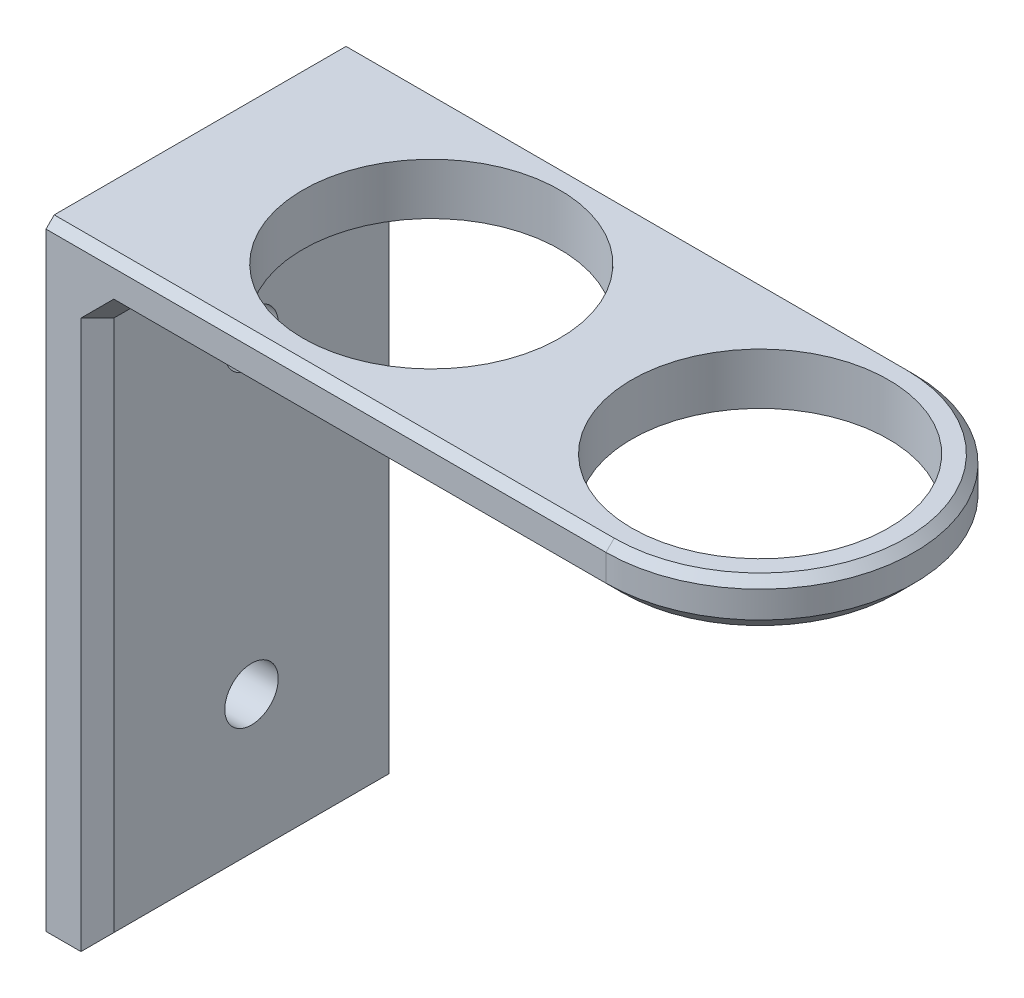
ISO-10303-21;
HEADER;
FILE_DESCRIPTION(('STEP AP214'),'2;1');
FILE_NAME('part.step','',(''),(''),'','','');
FILE_SCHEMA(('AUTOMOTIVE_DESIGN { 1 0 10303 214 1 1 1 1 }'));
ENDSEC;
DATA;
#1=APPLICATION_CONTEXT('core data for automotive mechanical design processes');
#2=APPLICATION_PROTOCOL_DEFINITION('international standard','automotive_design',2000,#1);
#3=PRODUCT_CONTEXT('',#1,'mechanical');
#4=PRODUCT('Part','Part','',(#3));
#5=PRODUCT_RELATED_PRODUCT_CATEGORY('part','',(#4));
#6=PRODUCT_DEFINITION_FORMATION('','',#4);
#7=PRODUCT_DEFINITION_CONTEXT('part definition',#1,'design');
#8=PRODUCT_DEFINITION('design','',#6,#7);
#9=PRODUCT_DEFINITION_SHAPE('','',#8);
#10=(LENGTH_UNIT() NAMED_UNIT(*) SI_UNIT(.MILLI.,.METRE.));
#11=(NAMED_UNIT(*) PLANE_ANGLE_UNIT() SI_UNIT($,.RADIAN.));
#12=(NAMED_UNIT(*) SI_UNIT($,.STERADIAN.) SOLID_ANGLE_UNIT());
#13=UNCERTAINTY_MEASURE_WITH_UNIT(LENGTH_MEASURE(1.E-05),#10,'distance_accuracy_value','');
#14=(GEOMETRIC_REPRESENTATION_CONTEXT(3) GLOBAL_UNCERTAINTY_ASSIGNED_CONTEXT((#13)) GLOBAL_UNIT_ASSIGNED_CONTEXT((#10,
#11,#12)) REPRESENTATION_CONTEXT('',''));
#15=CARTESIAN_POINT('',(0.,0.,0.));
#16=DIRECTION('',(0.,0.,1.));
#17=DIRECTION('',(1.,0.,0.));
#18=AXIS2_PLACEMENT_3D('',#15,#16,#17);
#19=CARTESIAN_POINT('',(6.35,0.,0.));
#20=DIRECTION('',(0.,0.,1.));
#21=DIRECTION('',(1.,0.,0.));
#22=AXIS2_PLACEMENT_3D('',#19,#20,#21);
#23=PLANE('',#22);
#24=DIRECTION('',(0.,1.,0.));
#25=VECTOR('',#24,1.);
#26=CARTESIAN_POINT('',(0.,0.,0.));
#27=LINE('',#26,#25);
#28=CARTESIAN_POINT('',(0.,-38.1,0.));
#29=VERTEX_POINT('',#28);
#30=CARTESIAN_POINT('',(0.,37.084,0.));
#31=VERTEX_POINT('',#30);
#32=EDGE_CURVE('E256',#29,#31,#27,.T.);
#33=ORIENTED_EDGE('',*,*,#32,.T.);
#34=DIRECTION('',(1.,0.,0.));
#35=VECTOR('',#34,1.);
#36=CARTESIAN_POINT('',(6.35,37.084,0.));
#37=LINE('',#36,#35);
#38=CARTESIAN_POINT('',(69.215,37.084,0.));
#39=VERTEX_POINT('',#38);
#40=EDGE_CURVE('E67',#31,#39,#37,.T.);
#41=ORIENTED_EDGE('',*,*,#40,.T.);
#42=DIRECTION('',(0.,1.,0.));
#43=VECTOR('',#42,1.);
#44=CARTESIAN_POINT('',(69.215,31.75,0.));
#45=LINE('',#44,#43);
#46=CARTESIAN_POINT('',(69.215,33.782,0.));
#47=VERTEX_POINT('',#46);
#48=EDGE_CURVE('E278',#47,#39,#45,.T.);
#49=ORIENTED_EDGE('',*,*,#48,.F.);
#50=DIRECTION('',(-1.,0.,0.));
#51=VECTOR('',#50,1.);
#52=CARTESIAN_POINT('',(6.35,33.782,0.));
#53=LINE('',#52,#51);
#54=CARTESIAN_POINT('',(8.38199999999999,33.782,0.));
#55=VERTEX_POINT('',#54);
#56=EDGE_CURVE('E150',#47,#55,#53,.T.);
#57=ORIENTED_EDGE('',*,*,#56,.T.);
#58=DIRECTION('',(0.707106781186548,0.707106781186548,0.));
#59=VECTOR('',#58,1.);
#60=CARTESIAN_POINT('',(8.38199999999999,33.782,0.));
#61=LINE('',#60,#59);
#62=CARTESIAN_POINT('',(6.35,31.75,0.));
#63=VERTEX_POINT('',#62);
#64=EDGE_CURVE('E145',#63,#55,#61,.T.);
#65=ORIENTED_EDGE('',*,*,#64,.F.);
#66=DIRECTION('',(0.707106781186548,0.707106781186548,0.));
#67=VECTOR('',#66,1.);
#68=CARTESIAN_POINT('',(8.38199999999999,33.782,0.));
#69=LINE('',#68,#67);
#70=CARTESIAN_POINT('',(4.31800000000001,29.718,0.));
#71=VERTEX_POINT('',#70);
#72=EDGE_CURVE('E147',#71,#63,#69,.T.);
#73=ORIENTED_EDGE('',*,*,#72,.F.);
#74=DIRECTION('',(0.,-1.,0.));
#75=VECTOR('',#74,1.);
#76=CARTESIAN_POINT('',(4.31800000000001,-38.1,0.));
#77=LINE('',#76,#75);
#78=CARTESIAN_POINT('',(4.31800000000001,-38.1,0.));
#79=VERTEX_POINT('',#78);
#80=EDGE_CURVE('E160',#71,#79,#77,.T.);
#81=ORIENTED_EDGE('',*,*,#80,.T.);
#82=DIRECTION('',(-1.,0.,0.));
#83=VECTOR('',#82,1.);
#84=CARTESIAN_POINT('',(6.35,-38.1,0.));
#85=LINE('',#84,#83);
#86=EDGE_CURVE('E263',#79,#29,#85,.T.);
#87=ORIENTED_EDGE('',*,*,#86,.T.);
#88=EDGE_LOOP('',(#33,#41,#49,#57,#65,#73,#81,#87));
#89=FACE_BOUND('',#88,.T.);
#90=ADVANCED_FACE('F42',(#89),#23,.F.);
#91=CARTESIAN_POINT('',(6.35,38.1,0.));
#92=DIRECTION('',(0.,-1.,0.));
#93=DIRECTION('',(0.,0.,-1.));
#94=AXIS2_PLACEMENT_3D('',#91,#92,#93);
#95=PLANE('',#94);
#96=CARTESIAN_POINT('',(69.215,38.1,19.05));
#97=DIRECTION('',(0.,-1.,0.));
#98=DIRECTION('',(0.,0.,-1.));
#99=AXIS2_PLACEMENT_3D('',#96,#97,#98);
#100=CIRCLE('',#99,18.034);
#101=CARTESIAN_POINT('',(69.215,38.1,37.084));
#102=VERTEX_POINT('',#101);
#103=CARTESIAN_POINT('',(69.215,38.1,1.01599999999999));
#104=VERTEX_POINT('',#103);
#105=EDGE_CURVE('E215',#102,#104,#100,.F.);
#106=ORIENTED_EDGE('',*,*,#105,.T.);
#107=DIRECTION('',(-1.,0.,0.));
#108=VECTOR('',#107,1.);
#109=CARTESIAN_POINT('',(6.35,38.1,1.01599999999999));
#110=LINE('',#109,#108);
#111=CARTESIAN_POINT('',(0.,38.1,1.01599999999999));
#112=VERTEX_POINT('',#111);
#113=EDGE_CURVE('E217',#104,#112,#110,.T.);
#114=ORIENTED_EDGE('',*,*,#113,.T.);
#115=DIRECTION('',(0.,0.,1.));
#116=VECTOR('',#115,1.);
#117=CARTESIAN_POINT('',(0.,38.1,0.));
#118=LINE('',#117,#116);
#119=CARTESIAN_POINT('',(0.,38.1,37.084));
#120=VERTEX_POINT('',#119);
#121=EDGE_CURVE('E254',#112,#120,#118,.T.);
#122=ORIENTED_EDGE('',*,*,#121,.T.);
#123=DIRECTION('',(1.,0.,0.));
#124=VECTOR('',#123,1.);
#125=CARTESIAN_POINT('',(6.35,38.1,37.084));
#126=LINE('',#125,#124);
#127=EDGE_CURVE('E188',#120,#102,#126,.T.);
#128=ORIENTED_EDGE('',*,*,#127,.T.);
#129=EDGE_LOOP('',(#106,#114,#122,#128));
#130=FACE_BOUND('',#129,.T.);
#131=CARTESIAN_POINT('',(69.215,38.1,19.05));
#132=DIRECTION('',(0.,1.,0.));
#133=DIRECTION('',(0.,0.,1.));
#134=AXIS2_PLACEMENT_3D('',#131,#132,#133);
#135=CIRCLE('',#134,15.875);
#136=CARTESIAN_POINT('',(69.215,38.1,34.925));
#137=VERTEX_POINT('',#136);
#138=EDGE_CURVE('E213',#137,#137,#135,.T.);
#139=ORIENTED_EDGE('',*,*,#138,.F.);
#140=EDGE_LOOP('',(#139));
#141=FACE_BOUND('',#140,.T.);
#142=CARTESIAN_POINT('',(28.575,38.1,19.05));
#143=DIRECTION('',(0.,1.,0.));
#144=DIRECTION('',(0.,0.,1.));
#145=AXIS2_PLACEMENT_3D('',#142,#143,#144);
#146=CIRCLE('',#145,15.875);
#147=CARTESIAN_POINT('',(28.575,38.1,34.925));
#148=VERTEX_POINT('',#147);
#149=EDGE_CURVE('E596',#148,#148,#146,.T.);
#150=ORIENTED_EDGE('',*,*,#149,.F.);
#151=EDGE_LOOP('',(#150));
#152=FACE_BOUND('',#151,.T.);
#153=ADVANCED_FACE('F319',(#130,#141,#152),#95,.F.);
#154=CARTESIAN_POINT('',(6.35,0.,38.1));
#155=DIRECTION('',(0.,0.,-1.));
#156=DIRECTION('',(-1.,0.,0.));
#157=AXIS2_PLACEMENT_3D('',#154,#155,#156);
#158=PLANE('',#157);
#159=DIRECTION('',(0.,1.,0.));
#160=VECTOR('',#159,1.);
#161=CARTESIAN_POINT('',(69.215,31.75,38.1));
#162=LINE('',#161,#160);
#163=CARTESIAN_POINT('',(69.215,33.782,38.1));
#164=VERTEX_POINT('',#163);
#165=CARTESIAN_POINT('',(69.215,37.084,38.1));
#166=VERTEX_POINT('',#165);
#167=EDGE_CURVE('E245',#164,#166,#162,.T.);
#168=ORIENTED_EDGE('',*,*,#167,.T.);
#169=DIRECTION('',(-1.,0.,0.));
#170=VECTOR('',#169,1.);
#171=CARTESIAN_POINT('',(6.35,37.084,38.1));
#172=LINE('',#171,#170);
#173=CARTESIAN_POINT('',(0.,37.084,38.1));
#174=VERTEX_POINT('',#173);
#175=EDGE_CURVE('E11',#166,#174,#172,.T.);
#176=ORIENTED_EDGE('',*,*,#175,.T.);
#177=DIRECTION('',(0.,-1.,0.));
#178=VECTOR('',#177,1.);
#179=CARTESIAN_POINT('',(0.,0.,38.1));
#180=LINE('',#179,#178);
#181=CARTESIAN_POINT('',(0.,-38.1,38.1));
#182=VERTEX_POINT('',#181);
#183=EDGE_CURVE('E243',#174,#182,#180,.T.);
#184=ORIENTED_EDGE('',*,*,#183,.T.);
#185=DIRECTION('',(-1.,0.,0.));
#186=VECTOR('',#185,1.);
#187=CARTESIAN_POINT('',(6.35,-38.1,38.1));
#188=LINE('',#187,#186);
#189=CARTESIAN_POINT('',(4.31800000000001,-38.1,38.1));
#190=VERTEX_POINT('',#189);
#191=EDGE_CURVE('E265',#190,#182,#188,.T.);
#192=ORIENTED_EDGE('',*,*,#191,.F.);
#193=DIRECTION('',(0.,1.,0.));
#194=VECTOR('',#193,1.);
#195=CARTESIAN_POINT('',(4.31800000000001,31.75,38.1));
#196=LINE('',#195,#194);
#197=CARTESIAN_POINT('',(4.31800000000001,29.718,38.1));
#198=VERTEX_POINT('',#197);
#199=EDGE_CURVE('E173',#190,#198,#196,.T.);
#200=ORIENTED_EDGE('',*,*,#199,.T.);
#201=DIRECTION('',(-0.707106781186548,-0.707106781186548,0.));
#202=VECTOR('',#201,1.);
#203=CARTESIAN_POINT('',(4.31800000000001,29.718,38.1));
#204=LINE('',#203,#202);
#205=CARTESIAN_POINT('',(6.35,31.75,38.1));
#206=VERTEX_POINT('',#205);
#207=EDGE_CURVE('E167',#206,#198,#204,.T.);
#208=ORIENTED_EDGE('',*,*,#207,.F.);
#209=DIRECTION('',(-0.707106781186548,-0.707106781186548,0.));
#210=VECTOR('',#209,1.);
#211=CARTESIAN_POINT('',(4.31800000000001,29.718,38.1));
#212=LINE('',#211,#210);
#213=CARTESIAN_POINT('',(8.38199999999999,33.782,38.1));
#214=VERTEX_POINT('',#213);
#215=EDGE_CURVE('E170',#214,#206,#212,.T.);
#216=ORIENTED_EDGE('',*,*,#215,.F.);
#217=DIRECTION('',(1.,0.,0.));
#218=VECTOR('',#217,1.);
#219=CARTESIAN_POINT('',(6.35,33.782,38.1));
#220=LINE('',#219,#218);
#221=EDGE_CURVE('E175',#214,#164,#220,.T.);
#222=ORIENTED_EDGE('',*,*,#221,.T.);
#223=EDGE_LOOP('',(#168,#176,#184,#192,#200,#208,#216,#222));
#224=FACE_BOUND('',#223,.T.);
#225=ADVANCED_FACE('F241',(#224),#158,.F.);
#226=CARTESIAN_POINT('',(6.35,-38.1,0.));
#227=DIRECTION('',(0.,1.,0.));
#228=DIRECTION('',(0.,0.,1.));
#229=AXIS2_PLACEMENT_3D('',#226,#227,#228);
#230=PLANE('',#229);
#231=ORIENTED_EDGE('',*,*,#86,.F.);
#232=DIRECTION('',(0.,0.,1.));
#233=VECTOR('',#232,1.);
#234=CARTESIAN_POINT('',(4.31800000000001,-38.1,38.1));
#235=LINE('',#234,#233);
#236=EDGE_CURVE('E186',#79,#190,#235,.T.);
#237=ORIENTED_EDGE('',*,*,#236,.T.);
#238=ORIENTED_EDGE('',*,*,#191,.T.);
#239=DIRECTION('',(0.,0.,-1.));
#240=VECTOR('',#239,1.);
#241=CARTESIAN_POINT('',(0.,-38.1,0.));
#242=LINE('',#241,#240);
#243=EDGE_CURVE('E253',#182,#29,#242,.T.);
#244=ORIENTED_EDGE('',*,*,#243,.T.);
#245=EDGE_LOOP('',(#231,#237,#238,#244));
#246=FACE_BOUND('',#245,.T.);
#247=ADVANCED_FACE('F313',(#246),#230,.F.);
#248=CARTESIAN_POINT('',(6.35,0.,0.));
#249=DIRECTION('',(1.,0.,0.));
#250=DIRECTION('',(0.,0.,-1.));
#251=AXIS2_PLACEMENT_3D('',#248,#249,#250);
#252=PLANE('',#251);
#253=DIRECTION('',(0.,-1.,0.));
#254=VECTOR('',#253,1.);
#255=CARTESIAN_POINT('',(6.35,-38.1,36.068));
#256=LINE('',#255,#254);
#257=CARTESIAN_POINT('',(6.35,29.718,36.068));
#258=VERTEX_POINT('',#257);
#259=CARTESIAN_POINT('',(6.35,-36.068,36.068));
#260=VERTEX_POINT('',#259);
#261=EDGE_CURVE('E179',#258,#260,#256,.T.);
#262=ORIENTED_EDGE('',*,*,#261,.T.);
#263=DIRECTION('',(0.,0.,-1.));
#264=VECTOR('',#263,1.);
#265=CARTESIAN_POINT('',(6.35,-36.068,0.));
#266=LINE('',#265,#264);
#267=CARTESIAN_POINT('',(6.35,-36.068,2.03199999999999));
#268=VERTEX_POINT('',#267);
#269=EDGE_CURVE('E183',#260,#268,#266,.T.);
#270=ORIENTED_EDGE('',*,*,#269,.T.);
#271=DIRECTION('',(0.,1.,0.));
#272=VECTOR('',#271,1.);
#273=CARTESIAN_POINT('',(6.35,31.75,2.03199999999999));
#274=LINE('',#273,#272);
#275=CARTESIAN_POINT('',(6.35,29.718,2.03199999999999));
#276=VERTEX_POINT('',#275);
#277=EDGE_CURVE('E181',#268,#276,#274,.T.);
#278=ORIENTED_EDGE('',*,*,#277,.T.);
#279=DIRECTION('',(0.,0.,1.));
#280=VECTOR('',#279,1.);
#281=CARTESIAN_POINT('',(6.35,29.718,0.));
#282=LINE('',#281,#280);
#283=EDGE_CURVE('E177',#276,#258,#282,.T.);
#284=ORIENTED_EDGE('',*,*,#283,.T.);
#285=EDGE_LOOP('',(#262,#270,#278,#284));
#286=FACE_BOUND('',#285,.T.);
#287=CARTESIAN_POINT('',(6.35,19.05,19.05));
#288=DIRECTION('',(1.,0.,0.));
#289=DIRECTION('',(0.,0.,-1.));
#290=AXIS2_PLACEMENT_3D('',#287,#288,#289);
#291=CIRCLE('',#290,3.302);
#292=CARTESIAN_POINT('',(6.35,19.05,15.748));
#293=VERTEX_POINT('',#292);
#294=EDGE_CURVE('E283',#293,#293,#291,.T.);
#295=ORIENTED_EDGE('',*,*,#294,.F.);
#296=EDGE_LOOP('',(#295));
#297=FACE_BOUND('',#296,.T.);
#298=CARTESIAN_POINT('',(6.35,-19.05,19.05));
#299=DIRECTION('',(1.,0.,0.));
#300=DIRECTION('',(0.,0.,-1.));
#301=AXIS2_PLACEMENT_3D('',#298,#299,#300);
#302=CIRCLE('',#301,3.302);
#303=CARTESIAN_POINT('',(6.35,-19.05,15.748));
#304=VERTEX_POINT('',#303);
#305=EDGE_CURVE('E295',#304,#304,#302,.T.);
#306=ORIENTED_EDGE('',*,*,#305,.F.);
#307=EDGE_LOOP('',(#306));
#308=FACE_BOUND('',#307,.T.);
#309=ADVANCED_FACE('F304',(#286,#297,#308),#252,.T.);
#310=CARTESIAN_POINT('',(0.,0.,0.));
#311=DIRECTION('',(1.,0.,0.));
#312=DIRECTION('',(0.,0.,-1.));
#313=AXIS2_PLACEMENT_3D('',#310,#311,#312);
#314=PLANE('',#313);
#315=CARTESIAN_POINT('',(0.,19.05,19.05));
#316=DIRECTION('',(1.,0.,0.));
#317=DIRECTION('',(0.,0.,-1.));
#318=AXIS2_PLACEMENT_3D('',#315,#316,#317);
#319=CIRCLE('',#318,3.302);
#320=CARTESIAN_POINT('',(0.,19.05,15.748));
#321=VERTEX_POINT('',#320);
#322=EDGE_CURVE('E292',#321,#321,#319,.F.);
#323=ORIENTED_EDGE('',*,*,#322,.F.);
#324=EDGE_LOOP('',(#323));
#325=FACE_BOUND('',#324,.T.);
#326=CARTESIAN_POINT('',(0.,-19.05,19.05));
#327=DIRECTION('',(1.,0.,0.));
#328=DIRECTION('',(0.,0.,-1.));
#329=AXIS2_PLACEMENT_3D('',#326,#327,#328);
#330=CIRCLE('',#329,3.302);
#331=CARTESIAN_POINT('',(0.,-19.05,15.748));
#332=VERTEX_POINT('',#331);
#333=EDGE_CURVE('E258',#332,#332,#330,.F.);
#334=ORIENTED_EDGE('',*,*,#333,.F.);
#335=EDGE_LOOP('',(#334));
#336=FACE_BOUND('',#335,.T.);
#337=ORIENTED_EDGE('',*,*,#121,.F.);
#338=DIRECTION('',(0.,0.707106781186543,0.707106781186552));
#339=VECTOR('',#338,1.);
#340=CARTESIAN_POINT('',(0.,38.1,1.01599999999999));
#341=LINE('',#340,#339);
#342=EDGE_CURVE('E222',#112,#31,#341,.F.);
#343=ORIENTED_EDGE('',*,*,#342,.T.);
#344=ORIENTED_EDGE('',*,*,#32,.F.);
#345=ORIENTED_EDGE('',*,*,#243,.F.);
#346=ORIENTED_EDGE('',*,*,#183,.F.);
#347=DIRECTION('',(0.,-0.707106781186543,0.707106781186552));
#348=VECTOR('',#347,1.);
#349=CARTESIAN_POINT('',(0.,37.084,38.1));
#350=LINE('',#349,#348);
#351=EDGE_CURVE('E220',#174,#120,#350,.F.);
#352=ORIENTED_EDGE('',*,*,#351,.T.);
#353=EDGE_LOOP('',(#337,#343,#344,#345,#346,#352));
#354=FACE_BOUND('',#353,.T.);
#355=ADVANCED_FACE('F249',(#325,#336,#354),#314,.F.);
#356=CARTESIAN_POINT('',(-9.33946636591193,-19.05,19.05));
#357=DIRECTION('',(1.,0.,0.));
#358=DIRECTION('',(0.,0.,-1.));
#359=AXIS2_PLACEMENT_3D('',#356,#357,#358);
#360=CYLINDRICAL_SURFACE('',#359,3.302);
#361=ORIENTED_EDGE('',*,*,#333,.T.);
#362=EDGE_LOOP('',(#361));
#363=FACE_BOUND('',#362,.T.);
#364=ORIENTED_EDGE('',*,*,#305,.T.);
#365=EDGE_LOOP('',(#364));
#366=FACE_BOUND('',#365,.T.);
#367=ADVANCED_FACE('F300',(#363,#366),#360,.F.);
#368=CARTESIAN_POINT('',(-9.33946636591192,19.05,19.05));
#369=DIRECTION('',(1.,0.,0.));
#370=DIRECTION('',(0.,0.,-1.));
#371=AXIS2_PLACEMENT_3D('',#368,#369,#370);
#372=CYLINDRICAL_SURFACE('',#371,3.302);
#373=ORIENTED_EDGE('',*,*,#322,.T.);
#374=EDGE_LOOP('',(#373));
#375=FACE_BOUND('',#374,.T.);
#376=ORIENTED_EDGE('',*,*,#294,.T.);
#377=EDGE_LOOP('',(#376));
#378=FACE_BOUND('',#377,.T.);
#379=ADVANCED_FACE('F311',(#375,#378),#372,.F.);
#380=CARTESIAN_POINT('',(69.215,31.75,19.05));
#381=DIRECTION('',(0.,1.,0.));
#382=DIRECTION('',(0.,0.,1.));
#383=AXIS2_PLACEMENT_3D('',#380,#381,#382);
#384=CYLINDRICAL_SURFACE('',#383,19.05);
#385=ORIENTED_EDGE('',*,*,#48,.T.);
#386=CARTESIAN_POINT('',(69.215,37.084,19.05));
#387=DIRECTION('',(0.,-1.,0.));
#388=DIRECTION('',(0.,0.,-1.));
#389=AXIS2_PLACEMENT_3D('',#386,#387,#388);
#390=CIRCLE('',#389,19.05);
#391=EDGE_CURVE('E52',#39,#166,#390,.T.);
#392=ORIENTED_EDGE('',*,*,#391,.T.);
#393=ORIENTED_EDGE('',*,*,#167,.F.);
#394=CARTESIAN_POINT('',(69.215,33.782,19.05));
#395=DIRECTION('',(0.,1.,0.));
#396=DIRECTION('',(0.,0.,1.));
#397=AXIS2_PLACEMENT_3D('',#394,#395,#396);
#398=CIRCLE('',#397,19.05);
#399=EDGE_CURVE('E162',#164,#47,#398,.T.);
#400=ORIENTED_EDGE('',*,*,#399,.T.);
#401=EDGE_LOOP('',(#385,#392,#393,#400));
#402=FACE_BOUND('',#401,.T.);
#403=ADVANCED_FACE('F277',(#402),#384,.T.);
#404=CARTESIAN_POINT('',(69.215,31.75,19.05));
#405=DIRECTION('',(0.,1.,0.));
#406=DIRECTION('',(0.,0.,1.));
#407=AXIS2_PLACEMENT_3D('',#404,#405,#406);
#408=CYLINDRICAL_SURFACE('',#407,15.875);
#409=CARTESIAN_POINT('',(69.215,31.75,19.05));
#410=DIRECTION('',(0.,1.,0.));
#411=DIRECTION('',(0.,0.,1.));
#412=AXIS2_PLACEMENT_3D('',#409,#410,#411);
#413=CIRCLE('',#412,15.875);
#414=CARTESIAN_POINT('',(69.215,31.75,34.925));
#415=VERTEX_POINT('',#414);
#416=EDGE_CURVE('E286',#415,#415,#413,.T.);
#417=ORIENTED_EDGE('',*,*,#416,.F.);
#418=EDGE_LOOP('',(#417));
#419=FACE_BOUND('',#418,.T.);
#420=ORIENTED_EDGE('',*,*,#138,.T.);
#421=EDGE_LOOP('',(#420));
#422=FACE_BOUND('',#421,.T.);
#423=ADVANCED_FACE('F458',(#419,#422),#408,.F.);
#424=CARTESIAN_POINT('',(28.575,31.75,19.05));
#425=DIRECTION('',(0.,1.,0.));
#426=DIRECTION('',(0.,0.,1.));
#427=AXIS2_PLACEMENT_3D('',#424,#425,#426);
#428=CYLINDRICAL_SURFACE('',#427,15.875);
#429=CARTESIAN_POINT('',(28.575,31.75,19.05));
#430=DIRECTION('',(0.,1.,0.));
#431=DIRECTION('',(0.,0.,1.));
#432=AXIS2_PLACEMENT_3D('',#429,#430,#431);
#433=CIRCLE('',#432,15.875);
#434=CARTESIAN_POINT('',(28.575,31.75,34.925));
#435=VERTEX_POINT('',#434);
#436=EDGE_CURVE('E281',#435,#435,#433,.T.);
#437=ORIENTED_EDGE('',*,*,#436,.F.);
#438=EDGE_LOOP('',(#437));
#439=FACE_BOUND('',#438,.T.);
#440=ORIENTED_EDGE('',*,*,#149,.T.);
#441=EDGE_LOOP('',(#440));
#442=FACE_BOUND('',#441,.T.);
#443=ADVANCED_FACE('F449',(#439,#442),#428,.F.);
#444=CARTESIAN_POINT('',(0.,31.75,0.));
#445=DIRECTION('',(0.,1.,0.));
#446=DIRECTION('',(0.,0.,1.));
#447=AXIS2_PLACEMENT_3D('',#444,#445,#446);
#448=PLANE('',#447);
#449=DIRECTION('',(1.,0.,0.));
#450=VECTOR('',#449,1.);
#451=CARTESIAN_POINT('',(0.,31.75,2.03199999999999));
#452=LINE('',#451,#450);
#453=CARTESIAN_POINT('',(8.38199999999999,31.75,2.03199999999999));
#454=VERTEX_POINT('',#453);
#455=CARTESIAN_POINT('',(69.215,31.75,2.03199999999999));
#456=VERTEX_POINT('',#455);
#457=EDGE_CURVE('E271',#454,#456,#452,.T.);
#458=ORIENTED_EDGE('',*,*,#457,.T.);
#459=CARTESIAN_POINT('',(69.215,31.75,19.05));
#460=DIRECTION('',(0.,1.,0.));
#461=DIRECTION('',(0.,0.,1.));
#462=AXIS2_PLACEMENT_3D('',#459,#460,#461);
#463=CIRCLE('',#462,17.018);
#464=CARTESIAN_POINT('',(69.215,31.75,36.068));
#465=VERTEX_POINT('',#464);
#466=EDGE_CURVE('E273',#456,#465,#463,.F.);
#467=ORIENTED_EDGE('',*,*,#466,.T.);
#468=DIRECTION('',(-1.,0.,0.));
#469=VECTOR('',#468,1.);
#470=CARTESIAN_POINT('',(0.,31.75,36.068));
#471=LINE('',#470,#469);
#472=CARTESIAN_POINT('',(8.38199999999999,31.75,36.068));
#473=VERTEX_POINT('',#472);
#474=EDGE_CURVE('E269',#465,#473,#471,.T.);
#475=ORIENTED_EDGE('',*,*,#474,.T.);
#476=DIRECTION('',(0.,0.,-1.));
#477=VECTOR('',#476,1.);
#478=CARTESIAN_POINT('',(8.38199999999999,31.75,0.));
#479=LINE('',#478,#477);
#480=EDGE_CURVE('E267',#473,#454,#479,.T.);
#481=ORIENTED_EDGE('',*,*,#480,.T.);
#482=EDGE_LOOP('',(#458,#467,#475,#481));
#483=FACE_BOUND('',#482,.T.);
#484=ORIENTED_EDGE('',*,*,#416,.T.);
#485=EDGE_LOOP('',(#484));
#486=FACE_BOUND('',#485,.T.);
#487=ORIENTED_EDGE('',*,*,#436,.T.);
#488=EDGE_LOOP('',(#487));
#489=FACE_BOUND('',#488,.T.);
#490=ADVANCED_FACE('F390',(#483,#486,#489),#448,.F.);
#491=CARTESIAN_POINT('',(6.35,-36.068,0.));
#492=DIRECTION('',(0.707106781186548,-0.707106781186548,0.));
#493=DIRECTION('',(0.,0.,1.));
#494=AXIS2_PLACEMENT_3D('',#491,#492,#493);
#495=PLANE('',#494);
#496=DIRECTION('',(0.577350269189626,0.577350269189626,-0.577350269189626));
#497=VECTOR('',#496,1.);
#498=CARTESIAN_POINT('',(18.3726666666667,-24.0453333333333,24.0453333333333));
#499=LINE('',#498,#497);
#500=EDGE_CURVE('E207',#190,#260,#499,.T.);
#501=ORIENTED_EDGE('',*,*,#500,.F.);
#502=ORIENTED_EDGE('',*,*,#236,.F.);
#503=DIRECTION('',(-0.577350269189626,-0.577350269189626,-0.577350269189626));
#504=VECTOR('',#503,1.);
#505=CARTESIAN_POINT('',(18.3726666666667,-24.0453333333333,14.0546666666667));
#506=LINE('',#505,#504);
#507=EDGE_CURVE('E210',#268,#79,#506,.T.);
#508=ORIENTED_EDGE('',*,*,#507,.F.);
#509=ORIENTED_EDGE('',*,*,#269,.F.);
#510=EDGE_LOOP('',(#501,#502,#508,#509));
#511=FACE_BOUND('',#510,.T.);
#512=ADVANCED_FACE('F384',(#511),#495,.T.);
#513=CARTESIAN_POINT('',(6.35,0.,2.03199999999999));
#514=DIRECTION('',(0.707106781186548,0.,-0.707106781186548));
#515=DIRECTION('',(0.,-1.,0.));
#516=AXIS2_PLACEMENT_3D('',#513,#514,#515);
#517=PLANE('',#516);
#518=ORIENTED_EDGE('',*,*,#507,.T.);
#519=ORIENTED_EDGE('',*,*,#80,.F.);
#520=DIRECTION('',(-0.707106781186548,0.,-0.707106781186548));
#521=VECTOR('',#520,1.);
#522=CARTESIAN_POINT('',(6.35,29.718,2.03199999999999));
#523=LINE('',#522,#521);
#524=EDGE_CURVE('E159',#276,#71,#523,.T.);
#525=ORIENTED_EDGE('',*,*,#524,.F.);
#526=ORIENTED_EDGE('',*,*,#277,.F.);
#527=EDGE_LOOP('',(#518,#519,#525,#526));
#528=FACE_BOUND('',#527,.T.);
#529=ADVANCED_FACE('F377',(#528),#517,.T.);
#530=CARTESIAN_POINT('',(8.38199999999999,31.75,0.));
#531=DIRECTION('',(-0.707106781186548,0.707106781186548,0.));
#532=DIRECTION('',(0.,0.,-1.));
#533=AXIS2_PLACEMENT_3D('',#530,#531,#532);
#534=PLANE('',#533);
#535=DIRECTION('',(0.707106781186548,0.707106781186548,0.));
#536=VECTOR('',#535,1.);
#537=CARTESIAN_POINT('',(6.35,29.718,36.068));
#538=LINE('',#537,#536);
#539=EDGE_CURVE('E201',#258,#473,#538,.T.);
#540=ORIENTED_EDGE('',*,*,#539,.F.);
#541=ORIENTED_EDGE('',*,*,#283,.F.);
#542=DIRECTION('',(-0.707106781186548,-0.707106781186548,0.));
#543=VECTOR('',#542,1.);
#544=CARTESIAN_POINT('',(8.38199999999999,31.75,2.03199999999999));
#545=LINE('',#544,#543);
#546=EDGE_CURVE('E204',#454,#276,#545,.T.);
#547=ORIENTED_EDGE('',*,*,#546,.F.);
#548=ORIENTED_EDGE('',*,*,#480,.F.);
#549=EDGE_LOOP('',(#540,#541,#547,#548));
#550=FACE_BOUND('',#549,.T.);
#551=ADVANCED_FACE('F370',(#550),#534,.F.);
#552=CARTESIAN_POINT('',(6.35,0.,36.068));
#553=DIRECTION('',(0.707106781186548,0.,0.707106781186548));
#554=DIRECTION('',(0.,1.,0.));
#555=AXIS2_PLACEMENT_3D('',#552,#553,#554);
#556=PLANE('',#555);
#557=ORIENTED_EDGE('',*,*,#500,.T.);
#558=ORIENTED_EDGE('',*,*,#261,.F.);
#559=DIRECTION('',(0.707106781186548,0.,-0.707106781186548));
#560=VECTOR('',#559,1.);
#561=CARTESIAN_POINT('',(4.31800000000001,29.718,38.1));
#562=LINE('',#561,#560);
#563=EDGE_CURVE('E198',#198,#258,#562,.T.);
#564=ORIENTED_EDGE('',*,*,#563,.F.);
#565=ORIENTED_EDGE('',*,*,#199,.F.);
#566=EDGE_LOOP('',(#557,#558,#564,#565));
#567=FACE_BOUND('',#566,.T.);
#568=ADVANCED_FACE('F364',(#567),#556,.T.);
#569=CARTESIAN_POINT('',(8.38199999999999,31.75,2.03199999999999));
#570=DIRECTION('',(0.577350269189626,-0.577350269189626,-0.577350269189626));
#571=DIRECTION('',(-0.707106781186547,0.,-0.707106781186547));
#572=AXIS2_PLACEMENT_3D('',#569,#570,#571);
#573=PLANE('',#572);
#574=ORIENTED_EDGE('',*,*,#72,.T.);
#575=ORIENTED_EDGE('',*,*,#64,.T.);
#576=DIRECTION('',(0.,-0.707106781186548,0.707106781186548));
#577=VECTOR('',#576,1.);
#578=CARTESIAN_POINT('',(8.38199999999999,33.782,0.));
#579=LINE('',#578,#577);
#580=EDGE_CURVE('E196',#454,#55,#579,.F.);
#581=ORIENTED_EDGE('',*,*,#580,.F.);
#582=ORIENTED_EDGE('',*,*,#546,.T.);
#583=ORIENTED_EDGE('',*,*,#524,.T.);
#584=EDGE_LOOP('',(#574,#575,#581,#582,#583));
#585=FACE_BOUND('',#584,.T.);
#586=ADVANCED_FACE('F156',(#585),#573,.T.);
#587=CARTESIAN_POINT('',(6.35,29.718,36.068));
#588=DIRECTION('',(0.577350269189626,-0.577350269189626,0.577350269189626));
#589=DIRECTION('',(0.707106781186547,0.,-0.707106781186547));
#590=AXIS2_PLACEMENT_3D('',#587,#588,#589);
#591=PLANE('',#590);
#592=ORIENTED_EDGE('',*,*,#563,.T.);
#593=ORIENTED_EDGE('',*,*,#539,.T.);
#594=DIRECTION('',(0.,0.707106781186548,0.707106781186548));
#595=VECTOR('',#594,1.);
#596=CARTESIAN_POINT('',(8.38199999999999,31.75,36.068));
#597=LINE('',#596,#595);
#598=EDGE_CURVE('E193',#214,#473,#597,.F.);
#599=ORIENTED_EDGE('',*,*,#598,.F.);
#600=ORIENTED_EDGE('',*,*,#215,.T.);
#601=ORIENTED_EDGE('',*,*,#207,.T.);
#602=EDGE_LOOP('',(#592,#593,#599,#600,#601));
#603=FACE_BOUND('',#602,.T.);
#604=ADVANCED_FACE('F351',(#603),#591,.T.);
#605=CARTESIAN_POINT('',(0.,31.75,2.03199999999999));
#606=DIRECTION('',(0.,0.707106781186548,0.707106781186548));
#607=DIRECTION('',(1.,0.,0.));
#608=AXIS2_PLACEMENT_3D('',#605,#606,#607);
#609=PLANE('',#608);
#610=ORIENTED_EDGE('',*,*,#580,.T.);
#611=ORIENTED_EDGE('',*,*,#56,.F.);
#612=DIRECTION('',(0.,0.707106781186548,-0.707106781186548));
#613=VECTOR('',#612,1.);
#614=CARTESIAN_POINT('',(69.215,31.75,2.03199999999999));
#615=LINE('',#614,#613);
#616=EDGE_CURVE('E191',#456,#47,#615,.T.);
#617=ORIENTED_EDGE('',*,*,#616,.F.);
#618=ORIENTED_EDGE('',*,*,#457,.F.);
#619=EDGE_LOOP('',(#610,#611,#617,#618));
#620=FACE_BOUND('',#619,.T.);
#621=ADVANCED_FACE('F344',(#620),#609,.F.);
#622=CARTESIAN_POINT('',(6.35,33.782,38.1));
#623=DIRECTION('',(0.,0.707106781186548,-0.707106781186548));
#624=DIRECTION('',(1.,0.,0.));
#625=AXIS2_PLACEMENT_3D('',#622,#623,#624);
#626=PLANE('',#625);
#627=ORIENTED_EDGE('',*,*,#598,.T.);
#628=ORIENTED_EDGE('',*,*,#474,.F.);
#629=DIRECTION('',(0.,-0.707106781186548,-0.707106781186548));
#630=VECTOR('',#629,1.);
#631=CARTESIAN_POINT('',(69.215,33.782,38.1));
#632=LINE('',#631,#630);
#633=EDGE_CURVE('E189',#164,#465,#632,.T.);
#634=ORIENTED_EDGE('',*,*,#633,.F.);
#635=ORIENTED_EDGE('',*,*,#221,.F.);
#636=EDGE_LOOP('',(#627,#628,#634,#635));
#637=FACE_BOUND('',#636,.T.);
#638=ADVANCED_FACE('F338',(#637),#626,.F.);
#639=CARTESIAN_POINT('',(69.215,31.75,19.05));
#640=DIRECTION('',(0.,1.,0.));
#641=DIRECTION('',(0.,0.,1.));
#642=AXIS2_PLACEMENT_3D('',#639,#640,#641);
#643=CONICAL_SURFACE('',#642,17.018,0.785398163397448);
#644=ORIENTED_EDGE('',*,*,#616,.T.);
#645=ORIENTED_EDGE('',*,*,#399,.F.);
#646=ORIENTED_EDGE('',*,*,#633,.T.);
#647=ORIENTED_EDGE('',*,*,#466,.F.);
#648=EDGE_LOOP('',(#644,#645,#646,#647));
#649=FACE_BOUND('',#648,.T.);
#650=ADVANCED_FACE('F332',(#649),#643,.T.);
#651=CARTESIAN_POINT('',(6.35,37.084,38.1));
#652=DIRECTION('',(0.,-0.707106781186552,-0.707106781186543));
#653=DIRECTION('',(-1.,0.,0.));
#654=AXIS2_PLACEMENT_3D('',#651,#652,#653);
#655=PLANE('',#654);
#656=ORIENTED_EDGE('',*,*,#351,.F.);
#657=ORIENTED_EDGE('',*,*,#175,.F.);
#658=DIRECTION('',(0.,-0.707106781186543,0.707106781186552));
#659=VECTOR('',#658,1.);
#660=CARTESIAN_POINT('',(69.215,38.1,37.084));
#661=LINE('',#660,#659);
#662=EDGE_CURVE('E47',#102,#166,#661,.T.);
#663=ORIENTED_EDGE('',*,*,#662,.F.);
#664=ORIENTED_EDGE('',*,*,#127,.F.);
#665=EDGE_LOOP('',(#656,#657,#663,#664));
#666=FACE_BOUND('',#665,.T.);
#667=ADVANCED_FACE('F45',(#666),#655,.F.);
#668=CARTESIAN_POINT('',(69.215,37.084,19.05));
#669=DIRECTION('',(0.,-1.,0.));
#670=DIRECTION('',(0.,0.,-1.));
#671=AXIS2_PLACEMENT_3D('',#668,#669,#670);
#672=CONICAL_SURFACE('',#671,19.05,0.785398163397455);
#673=ORIENTED_EDGE('',*,*,#662,.T.);
#674=ORIENTED_EDGE('',*,*,#391,.F.);
#675=DIRECTION('',(0.,-0.707106781186543,-0.707106781186552));
#676=VECTOR('',#675,1.);
#677=CARTESIAN_POINT('',(69.215,38.1,1.01599999999999));
#678=LINE('',#677,#676);
#679=EDGE_CURVE('E225',#104,#39,#678,.T.);
#680=ORIENTED_EDGE('',*,*,#679,.F.);
#681=ORIENTED_EDGE('',*,*,#105,.F.);
#682=EDGE_LOOP('',(#673,#674,#680,#681));
#683=FACE_BOUND('',#682,.T.);
#684=ADVANCED_FACE('F234',(#683),#672,.T.);
#685=CARTESIAN_POINT('',(6.35,38.1,1.01599999999999));
#686=DIRECTION('',(0.,-0.707106781186552,0.707106781186543));
#687=DIRECTION('',(-1.,0.,0.));
#688=AXIS2_PLACEMENT_3D('',#685,#686,#687);
#689=PLANE('',#688);
#690=ORIENTED_EDGE('',*,*,#679,.T.);
#691=ORIENTED_EDGE('',*,*,#40,.F.);
#692=ORIENTED_EDGE('',*,*,#342,.F.);
#693=ORIENTED_EDGE('',*,*,#113,.F.);
#694=EDGE_LOOP('',(#690,#691,#692,#693));
#695=FACE_BOUND('',#694,.T.);
#696=ADVANCED_FACE('F393',(#695),#689,.F.);
#697=CLOSED_SHELL('',(#90,#153,#225,#247,#309,#355,#367,#379,#403,#423,#443,#490,#512,#529,#551,
#568,#586,#604,#621,#638,#650,#667,#684,#696));
#698=MANIFOLD_SOLID_BREP('B2',#697);
#699=ADVANCED_BREP_SHAPE_REPRESENTATION('',(#18,#698),#14);
#700=SHAPE_DEFINITION_REPRESENTATION(#9,#699);
ENDSEC;
END-ISO-10303-21;
